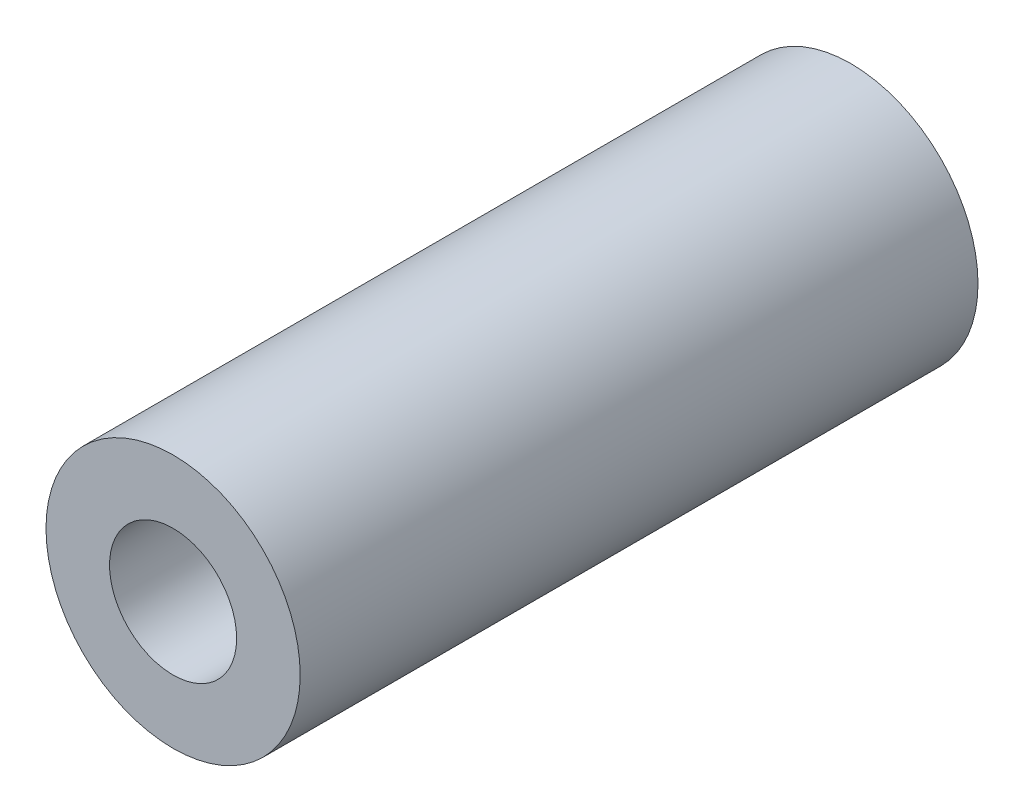
ISO-10303-21;
HEADER;
FILE_DESCRIPTION(('STEP AP214'),'2;1');
FILE_NAME('part.step','',(''),(''),'','','');
FILE_SCHEMA(('AUTOMOTIVE_DESIGN { 1 0 10303 214 1 1 1 1 }'));
ENDSEC;
DATA;
#1=APPLICATION_CONTEXT('core data for automotive mechanical design processes');
#2=APPLICATION_PROTOCOL_DEFINITION('international standard','automotive_design',2000,#1);
#3=PRODUCT_CONTEXT('',#1,'mechanical');
#4=PRODUCT('Part','Part','',(#3));
#5=PRODUCT_RELATED_PRODUCT_CATEGORY('part','',(#4));
#6=PRODUCT_DEFINITION_FORMATION('','',#4);
#7=PRODUCT_DEFINITION_CONTEXT('part definition',#1,'design');
#8=PRODUCT_DEFINITION('design','',#6,#7);
#9=PRODUCT_DEFINITION_SHAPE('','',#8);
#10=(LENGTH_UNIT() NAMED_UNIT(*) SI_UNIT(.MILLI.,.METRE.));
#11=(NAMED_UNIT(*) PLANE_ANGLE_UNIT() SI_UNIT($,.RADIAN.));
#12=(NAMED_UNIT(*) SI_UNIT($,.STERADIAN.) SOLID_ANGLE_UNIT());
#13=UNCERTAINTY_MEASURE_WITH_UNIT(LENGTH_MEASURE(1.E-05),#10,'distance_accuracy_value','');
#14=(GEOMETRIC_REPRESENTATION_CONTEXT(3) GLOBAL_UNCERTAINTY_ASSIGNED_CONTEXT((#13)) GLOBAL_UNIT_ASSIGNED_CONTEXT((#10,
#11,#12)) REPRESENTATION_CONTEXT('',''));
#15=CARTESIAN_POINT('',(0.,0.,0.));
#16=DIRECTION('',(0.,0.,1.));
#17=DIRECTION('',(1.,0.,0.));
#18=AXIS2_PLACEMENT_3D('',#15,#16,#17);
#19=CARTESIAN_POINT('',(0.,0.,16.));
#20=DIRECTION('',(0.,0.,1.));
#21=DIRECTION('',(1.,0.,0.));
#22=AXIS2_PLACEMENT_3D('',#19,#20,#21);
#23=PLANE('',#22);
#24=CARTESIAN_POINT('',(0.,0.,16.));
#25=DIRECTION('',(0.,0.,1.));
#26=DIRECTION('',(1.,0.,0.));
#27=AXIS2_PLACEMENT_3D('',#24,#25,#26);
#28=CIRCLE('',#27,3.);
#29=CARTESIAN_POINT('',(3.,0.,16.));
#30=VERTEX_POINT('',#29);
#31=EDGE_CURVE('E10',#30,#30,#28,.T.);
#32=ORIENTED_EDGE('',*,*,#31,.T.);
#33=EDGE_LOOP('',(#32));
#34=FACE_BOUND('',#33,.T.);
#35=CARTESIAN_POINT('',(0.,0.,16.));
#36=DIRECTION('',(0.,0.,1.));
#37=DIRECTION('',(1.,0.,0.));
#38=AXIS2_PLACEMENT_3D('',#35,#36,#37);
#39=CIRCLE('',#38,1.5);
#40=CARTESIAN_POINT('',(1.5,0.,16.));
#41=VERTEX_POINT('',#40);
#42=EDGE_CURVE('E42',#41,#41,#39,.T.);
#43=ORIENTED_EDGE('',*,*,#42,.F.);
#44=EDGE_LOOP('',(#43));
#45=FACE_BOUND('',#44,.T.);
#46=ADVANCED_FACE('F31',(#34,#45),#23,.T.);
#47=CARTESIAN_POINT('',(0.,0.,0.));
#48=DIRECTION('',(0.,0.,1.));
#49=DIRECTION('',(1.,0.,0.));
#50=AXIS2_PLACEMENT_3D('',#47,#48,#49);
#51=PLANE('',#50);
#52=CARTESIAN_POINT('',(0.,0.,0.));
#53=DIRECTION('',(0.,0.,1.));
#54=DIRECTION('',(1.,0.,0.));
#55=AXIS2_PLACEMENT_3D('',#52,#53,#54);
#56=CIRCLE('',#55,3.);
#57=CARTESIAN_POINT('',(3.,0.,0.));
#58=VERTEX_POINT('',#57);
#59=EDGE_CURVE('E35',#58,#58,#56,.T.);
#60=ORIENTED_EDGE('',*,*,#59,.F.);
#61=EDGE_LOOP('',(#60));
#62=FACE_BOUND('',#61,.T.);
#63=CARTESIAN_POINT('',(0.,0.,0.));
#64=DIRECTION('',(0.,0.,1.));
#65=DIRECTION('',(1.,0.,0.));
#66=AXIS2_PLACEMENT_3D('',#63,#64,#65);
#67=CIRCLE('',#66,1.5);
#68=CARTESIAN_POINT('',(1.5,0.,0.));
#69=VERTEX_POINT('',#68);
#70=EDGE_CURVE('E44',#69,#69,#67,.T.);
#71=ORIENTED_EDGE('',*,*,#70,.T.);
#72=EDGE_LOOP('',(#71));
#73=FACE_BOUND('',#72,.T.);
#74=ADVANCED_FACE('F54',(#62,#73),#51,.F.);
#75=CARTESIAN_POINT('',(0.,0.,16.));
#76=DIRECTION('',(0.,0.,-1.));
#77=DIRECTION('',(-1.,0.,0.));
#78=AXIS2_PLACEMENT_3D('',#75,#76,#77);
#79=CYLINDRICAL_SURFACE('',#78,3.);
#80=ORIENTED_EDGE('',*,*,#31,.F.);
#81=EDGE_LOOP('',(#80));
#82=FACE_BOUND('',#81,.T.);
#83=ORIENTED_EDGE('',*,*,#59,.T.);
#84=EDGE_LOOP('',(#83));
#85=FACE_BOUND('',#84,.T.);
#86=ADVANCED_FACE('F33',(#82,#85),#79,.T.);
#87=CARTESIAN_POINT('',(0.,0.,16.));
#88=DIRECTION('',(0.,0.,-1.));
#89=DIRECTION('',(-1.,0.,0.));
#90=AXIS2_PLACEMENT_3D('',#87,#88,#89);
#91=CYLINDRICAL_SURFACE('',#90,1.5);
#92=ORIENTED_EDGE('',*,*,#42,.T.);
#93=EDGE_LOOP('',(#92));
#94=FACE_BOUND('',#93,.T.);
#95=ORIENTED_EDGE('',*,*,#70,.F.);
#96=EDGE_LOOP('',(#95));
#97=FACE_BOUND('',#96,.T.);
#98=ADVANCED_FACE('F50',(#94,#97),#91,.F.);
#99=CLOSED_SHELL('',(#46,#74,#86,#98));
#100=MANIFOLD_SOLID_BREP('B2',#99);
#101=ADVANCED_BREP_SHAPE_REPRESENTATION('',(#18,#100),#14);
#102=SHAPE_DEFINITION_REPRESENTATION(#9,#101);
ENDSEC;
END-ISO-10303-21;
